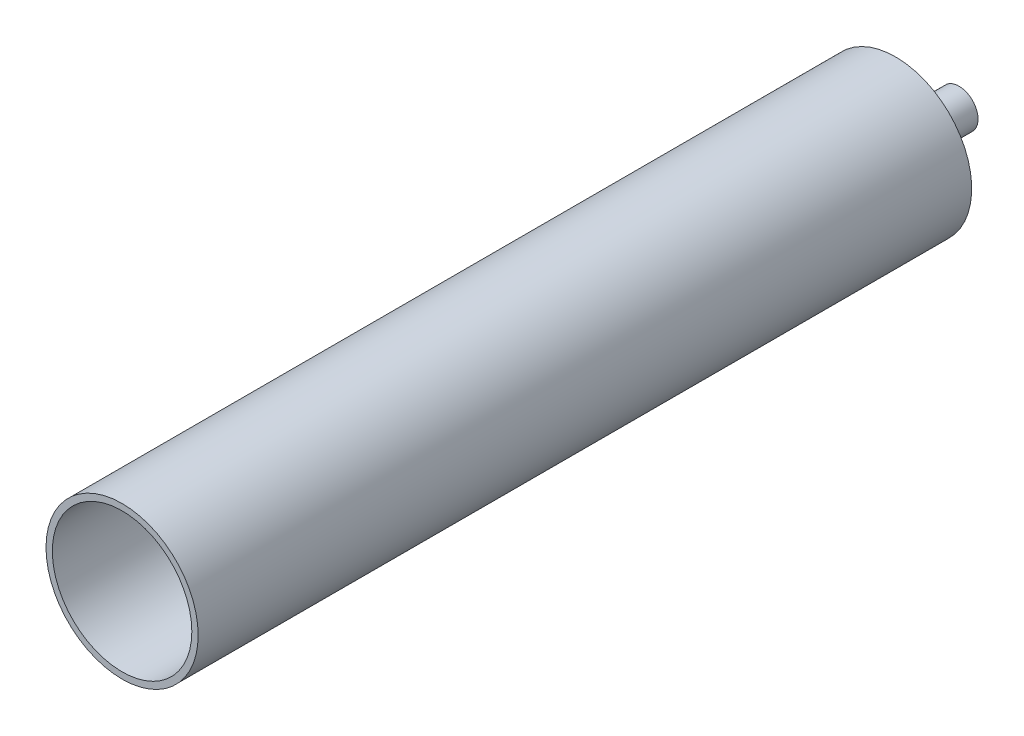
ISO-10303-21;
HEADER;
FILE_DESCRIPTION(('STEP AP214'),'2;1');
FILE_NAME('part.step','',(''),(''),'','','');
FILE_SCHEMA(('AUTOMOTIVE_DESIGN { 1 0 10303 214 1 1 1 1 }'));
ENDSEC;
DATA;
#1=APPLICATION_CONTEXT('core data for automotive mechanical design processes');
#2=APPLICATION_PROTOCOL_DEFINITION('international standard','automotive_design',2000,#1);
#3=PRODUCT_CONTEXT('',#1,'mechanical');
#4=PRODUCT('Part','Part','',(#3));
#5=PRODUCT_RELATED_PRODUCT_CATEGORY('part','',(#4));
#6=PRODUCT_DEFINITION_FORMATION('','',#4);
#7=PRODUCT_DEFINITION_CONTEXT('part definition',#1,'design');
#8=PRODUCT_DEFINITION('design','',#6,#7);
#9=PRODUCT_DEFINITION_SHAPE('','',#8);
#10=(LENGTH_UNIT() NAMED_UNIT(*) SI_UNIT(.MILLI.,.METRE.));
#11=(NAMED_UNIT(*) PLANE_ANGLE_UNIT() SI_UNIT($,.RADIAN.));
#12=(NAMED_UNIT(*) SI_UNIT($,.STERADIAN.) SOLID_ANGLE_UNIT());
#13=UNCERTAINTY_MEASURE_WITH_UNIT(LENGTH_MEASURE(1.E-05),#10,'distance_accuracy_value','');
#14=(GEOMETRIC_REPRESENTATION_CONTEXT(3) GLOBAL_UNCERTAINTY_ASSIGNED_CONTEXT((#13)) GLOBAL_UNIT_ASSIGNED_CONTEXT((#10,
#11,#12)) REPRESENTATION_CONTEXT('',''));
#15=CARTESIAN_POINT('',(0.,0.,0.));
#16=DIRECTION('',(0.,0.,1.));
#17=DIRECTION('',(1.,0.,0.));
#18=AXIS2_PLACEMENT_3D('',#15,#16,#17);
#19=CARTESIAN_POINT('',(0.,0.,76.2));
#20=DIRECTION('',(0.,0.,1.));
#21=DIRECTION('',(1.,0.,0.));
#22=AXIS2_PLACEMENT_3D('',#19,#20,#21);
#23=PLANE('',#22);
#24=CARTESIAN_POINT('',(0.,0.,76.2));
#25=DIRECTION('',(0.,0.,1.));
#26=DIRECTION('',(1.,0.,0.));
#27=AXIS2_PLACEMENT_3D('',#24,#25,#26);
#28=CIRCLE('',#27,7.62);
#29=CARTESIAN_POINT('',(7.62,0.,76.2));
#30=VERTEX_POINT('',#29);
#31=EDGE_CURVE('E41',#30,#30,#28,.T.);
#32=ORIENTED_EDGE('',*,*,#31,.T.);
#33=EDGE_LOOP('',(#32));
#34=FACE_BOUND('',#33,.T.);
#35=CARTESIAN_POINT('',(0.,0.,76.2));
#36=DIRECTION('',(0.,0.,1.));
#37=DIRECTION('',(1.,0.,0.));
#38=AXIS2_PLACEMENT_3D('',#35,#36,#37);
#39=CIRCLE('',#38,6.985);
#40=CARTESIAN_POINT('',(6.985,0.,76.2));
#41=VERTEX_POINT('',#40);
#42=EDGE_CURVE('E45',#41,#41,#39,.T.);
#43=ORIENTED_EDGE('',*,*,#42,.F.);
#44=EDGE_LOOP('',(#43));
#45=FACE_BOUND('',#44,.T.);
#46=ADVANCED_FACE('F34',(#34,#45),#23,.T.);
#47=CARTESIAN_POINT('',(0.,0.,76.2));
#48=DIRECTION('',(0.,0.,-1.));
#49=DIRECTION('',(-1.,0.,0.));
#50=AXIS2_PLACEMENT_3D('',#47,#48,#49);
#51=CYLINDRICAL_SURFACE('',#50,7.62);
#52=ORIENTED_EDGE('',*,*,#31,.F.);
#53=EDGE_LOOP('',(#52));
#54=FACE_BOUND('',#53,.T.);
#55=CARTESIAN_POINT('',(0.,0.,-1.27));
#56=DIRECTION('',(0.,0.,-1.));
#57=DIRECTION('',(-1.,0.,0.));
#58=AXIS2_PLACEMENT_3D('',#55,#56,#57);
#59=CIRCLE('',#58,7.62);
#60=CARTESIAN_POINT('',(-7.62,0.,-1.27));
#61=VERTEX_POINT('',#60);
#62=EDGE_CURVE('E53',#61,#61,#59,.T.);
#63=ORIENTED_EDGE('',*,*,#62,.F.);
#64=EDGE_LOOP('',(#63));
#65=FACE_BOUND('',#64,.T.);
#66=ADVANCED_FACE('F36',(#54,#65),#51,.T.);
#67=CARTESIAN_POINT('',(0.,0.,76.2));
#68=DIRECTION('',(0.,0.,-1.));
#69=DIRECTION('',(-1.,0.,0.));
#70=AXIS2_PLACEMENT_3D('',#67,#68,#69);
#71=CYLINDRICAL_SURFACE('',#70,6.985);
#72=ORIENTED_EDGE('',*,*,#42,.T.);
#73=EDGE_LOOP('',(#72));
#74=FACE_BOUND('',#73,.T.);
#75=CARTESIAN_POINT('',(0.,0.,0.));
#76=DIRECTION('',(0.,0.,1.));
#77=DIRECTION('',(1.,0.,0.));
#78=AXIS2_PLACEMENT_3D('',#75,#76,#77);
#79=CIRCLE('',#78,6.985);
#80=CARTESIAN_POINT('',(6.985,0.,0.));
#81=VERTEX_POINT('',#80);
#82=EDGE_CURVE('E49',#81,#81,#79,.T.);
#83=ORIENTED_EDGE('',*,*,#82,.F.);
#84=EDGE_LOOP('',(#83));
#85=FACE_BOUND('',#84,.T.);
#86=ADVANCED_FACE('F73',(#74,#85),#71,.F.);
#87=CARTESIAN_POINT('',(0.,0.,0.));
#88=DIRECTION('',(0.,0.,-1.));
#89=DIRECTION('',(-1.,0.,0.));
#90=AXIS2_PLACEMENT_3D('',#87,#88,#89);
#91=PLANE('',#90);
#92=CARTESIAN_POINT('',(0.,0.,0.));
#93=DIRECTION('',(0.,0.,-1.));
#94=DIRECTION('',(-1.,0.,0.));
#95=AXIS2_PLACEMENT_3D('',#92,#93,#94);
#96=CIRCLE('',#95,1.27);
#97=CARTESIAN_POINT('',(-1.27,0.,0.));
#98=VERTEX_POINT('',#97);
#99=EDGE_CURVE('E63',#98,#98,#96,.F.);
#100=ORIENTED_EDGE('',*,*,#99,.F.);
#101=EDGE_LOOP('',(#100));
#102=FACE_BOUND('',#101,.T.);
#103=ORIENTED_EDGE('',*,*,#82,.T.);
#104=EDGE_LOOP('',(#103));
#105=FACE_BOUND('',#104,.T.);
#106=ADVANCED_FACE('F69',(#102,#105),#91,.F.);
#107=CARTESIAN_POINT('',(0.,0.,-1.27));
#108=DIRECTION('',(0.,0.,-1.));
#109=DIRECTION('',(-1.,0.,0.));
#110=AXIS2_PLACEMENT_3D('',#107,#108,#109);
#111=PLANE('',#110);
#112=CARTESIAN_POINT('',(0.,0.,-1.27));
#113=DIRECTION('',(0.,0.,-1.));
#114=DIRECTION('',(-1.,0.,0.));
#115=AXIS2_PLACEMENT_3D('',#112,#113,#114);
#116=CIRCLE('',#115,1.905);
#117=CARTESIAN_POINT('',(-1.905,0.,-1.27));
#118=VERTEX_POINT('',#117);
#119=EDGE_CURVE('E10',#118,#118,#116,.T.);
#120=ORIENTED_EDGE('',*,*,#119,.F.);
#121=EDGE_LOOP('',(#120));
#122=FACE_BOUND('',#121,.T.);
#123=ORIENTED_EDGE('',*,*,#62,.T.);
#124=EDGE_LOOP('',(#123));
#125=FACE_BOUND('',#124,.T.);
#126=ADVANCED_FACE('F72',(#122,#125),#111,.T.);
#127=CARTESIAN_POINT('',(0.,0.,5.38815367264149));
#128=DIRECTION('',(0.,0.,-1.));
#129=DIRECTION('',(-1.,0.,0.));
#130=AXIS2_PLACEMENT_3D('',#127,#128,#129);
#131=CYLINDRICAL_SURFACE('',#130,1.905);
#132=ORIENTED_EDGE('',*,*,#119,.T.);
#133=EDGE_LOOP('',(#132));
#134=FACE_BOUND('',#133,.T.);
#135=CARTESIAN_POINT('',(0.,0.,-7.62));
#136=DIRECTION('',(0.,0.,-1.));
#137=DIRECTION('',(-1.,0.,0.));
#138=AXIS2_PLACEMENT_3D('',#135,#136,#137);
#139=CIRCLE('',#138,1.905);
#140=CARTESIAN_POINT('',(-1.905,0.,-7.62));
#141=VERTEX_POINT('',#140);
#142=EDGE_CURVE('E57',#141,#141,#139,.T.);
#143=ORIENTED_EDGE('',*,*,#142,.F.);
#144=EDGE_LOOP('',(#143));
#145=FACE_BOUND('',#144,.T.);
#146=ADVANCED_FACE('F106',(#134,#145),#131,.T.);
#147=CARTESIAN_POINT('',(0.,0.,5.38815367264149));
#148=DIRECTION('',(0.,0.,-1.));
#149=DIRECTION('',(-1.,0.,0.));
#150=AXIS2_PLACEMENT_3D('',#147,#148,#149);
#151=CYLINDRICAL_SURFACE('',#150,1.27);
#152=CARTESIAN_POINT('',(0.,0.,-7.62));
#153=DIRECTION('',(0.,0.,-1.));
#154=DIRECTION('',(-1.,0.,0.));
#155=AXIS2_PLACEMENT_3D('',#152,#153,#154);
#156=CIRCLE('',#155,1.27);
#157=CARTESIAN_POINT('',(-1.27,0.,-7.62));
#158=VERTEX_POINT('',#157);
#159=EDGE_CURVE('E60',#158,#158,#156,.T.);
#160=ORIENTED_EDGE('',*,*,#159,.T.);
#161=EDGE_LOOP('',(#160));
#162=FACE_BOUND('',#161,.T.);
#163=ORIENTED_EDGE('',*,*,#99,.T.);
#164=EDGE_LOOP('',(#163));
#165=FACE_BOUND('',#164,.T.);
#166=ADVANCED_FACE('F67',(#162,#165),#151,.F.);
#167=CARTESIAN_POINT('',(0.,0.,-7.62));
#168=DIRECTION('',(0.,0.,-1.));
#169=DIRECTION('',(-1.,0.,0.));
#170=AXIS2_PLACEMENT_3D('',#167,#168,#169);
#171=PLANE('',#170);
#172=ORIENTED_EDGE('',*,*,#142,.T.);
#173=EDGE_LOOP('',(#172));
#174=FACE_BOUND('',#173,.T.);
#175=ORIENTED_EDGE('',*,*,#159,.F.);
#176=EDGE_LOOP('',(#175));
#177=FACE_BOUND('',#176,.T.);
#178=ADVANCED_FACE('F122',(#174,#177),#171,.T.);
#179=CLOSED_SHELL('',(#46,#66,#86,#106,#126,#146,#166,#178));
#180=MANIFOLD_SOLID_BREP('B2',#179);
#181=ADVANCED_BREP_SHAPE_REPRESENTATION('',(#18,#180),#14);
#182=SHAPE_DEFINITION_REPRESENTATION(#9,#181);
ENDSEC;
END-ISO-10303-21;
